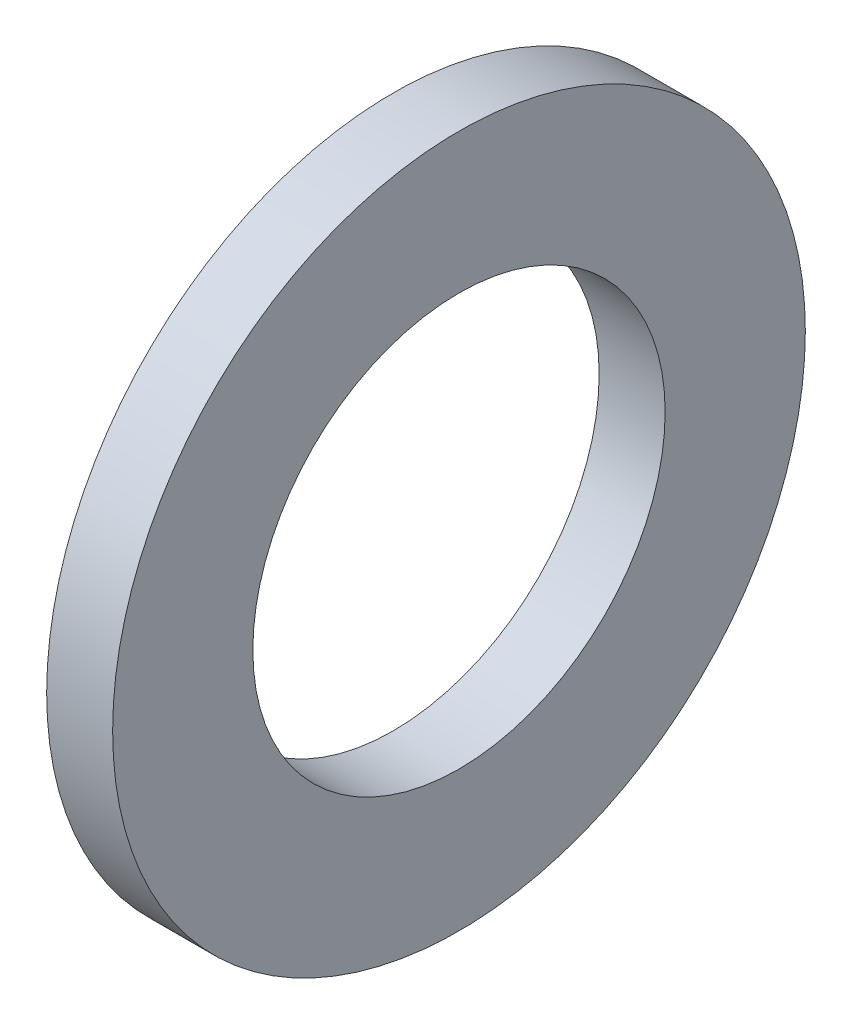
ISO-10303-21;
HEADER;
FILE_DESCRIPTION(('STEP AP214'),'2;1');
FILE_NAME('part.step','',(''),(''),'','','');
FILE_SCHEMA(('AUTOMOTIVE_DESIGN { 1 0 10303 214 1 1 1 1 }'));
ENDSEC;
DATA;
#1=APPLICATION_CONTEXT('core data for automotive mechanical design processes');
#2=APPLICATION_PROTOCOL_DEFINITION('international standard','automotive_design',2000,#1);
#3=PRODUCT_CONTEXT('',#1,'mechanical');
#4=PRODUCT('Part','Part','',(#3));
#5=PRODUCT_RELATED_PRODUCT_CATEGORY('part','',(#4));
#6=PRODUCT_DEFINITION_FORMATION('','',#4);
#7=PRODUCT_DEFINITION_CONTEXT('part definition',#1,'design');
#8=PRODUCT_DEFINITION('design','',#6,#7);
#9=PRODUCT_DEFINITION_SHAPE('','',#8);
#10=(LENGTH_UNIT() NAMED_UNIT(*) SI_UNIT(.MILLI.,.METRE.));
#11=(NAMED_UNIT(*) PLANE_ANGLE_UNIT() SI_UNIT($,.RADIAN.));
#12=(NAMED_UNIT(*) SI_UNIT($,.STERADIAN.) SOLID_ANGLE_UNIT());
#13=UNCERTAINTY_MEASURE_WITH_UNIT(LENGTH_MEASURE(1.E-05),#10,'distance_accuracy_value','');
#14=(GEOMETRIC_REPRESENTATION_CONTEXT(3) GLOBAL_UNCERTAINTY_ASSIGNED_CONTEXT((#13)) GLOBAL_UNIT_ASSIGNED_CONTEXT((#10,
#11,#12)) REPRESENTATION_CONTEXT('',''));
#15=CARTESIAN_POINT('',(0.,0.,0.));
#16=DIRECTION('',(0.,0.,1.));
#17=DIRECTION('',(1.,0.,0.));
#18=AXIS2_PLACEMENT_3D('',#15,#16,#17);
#19=CARTESIAN_POINT('',(4.,0.,0.));
#20=DIRECTION('',(1.,0.,0.));
#21=DIRECTION('',(0.,0.,-1.));
#22=AXIS2_PLACEMENT_3D('',#19,#20,#21);
#23=PLANE('',#22);
#24=CARTESIAN_POINT('',(4.,0.,0.));
#25=DIRECTION('',(1.,0.,0.));
#26=DIRECTION('',(0.,0.,-1.));
#27=AXIS2_PLACEMENT_3D('',#24,#25,#26);
#28=CIRCLE('',#27,21.);
#29=CARTESIAN_POINT('',(4.,0.,-21.));
#30=VERTEX_POINT('',#29);
#31=EDGE_CURVE('E10',#30,#30,#28,.T.);
#32=ORIENTED_EDGE('',*,*,#31,.T.);
#33=EDGE_LOOP('',(#32));
#34=FACE_BOUND('',#33,.T.);
#35=CARTESIAN_POINT('',(4.,0.,0.));
#36=DIRECTION('',(1.,0.,0.));
#37=DIRECTION('',(0.,0.,-1.));
#38=AXIS2_PLACEMENT_3D('',#35,#36,#37);
#39=CIRCLE('',#38,12.5);
#40=CARTESIAN_POINT('',(4.,0.,-12.5));
#41=VERTEX_POINT('',#40);
#42=EDGE_CURVE('E41',#41,#41,#39,.T.);
#43=ORIENTED_EDGE('',*,*,#42,.F.);
#44=EDGE_LOOP('',(#43));
#45=FACE_BOUND('',#44,.T.);
#46=ADVANCED_FACE('F30',(#34,#45),#23,.T.);
#47=CARTESIAN_POINT('',(0.,0.,0.));
#48=DIRECTION('',(1.,0.,0.));
#49=DIRECTION('',(0.,0.,-1.));
#50=AXIS2_PLACEMENT_3D('',#47,#48,#49);
#51=PLANE('',#50);
#52=CARTESIAN_POINT('',(0.,0.,0.));
#53=DIRECTION('',(1.,0.,0.));
#54=DIRECTION('',(0.,0.,-1.));
#55=AXIS2_PLACEMENT_3D('',#52,#53,#54);
#56=CIRCLE('',#55,21.);
#57=CARTESIAN_POINT('',(0.,0.,-21.));
#58=VERTEX_POINT('',#57);
#59=EDGE_CURVE('E34',#58,#58,#56,.T.);
#60=ORIENTED_EDGE('',*,*,#59,.F.);
#61=EDGE_LOOP('',(#60));
#62=FACE_BOUND('',#61,.T.);
#63=CARTESIAN_POINT('',(0.,0.,0.));
#64=DIRECTION('',(1.,0.,0.));
#65=DIRECTION('',(0.,0.,-1.));
#66=AXIS2_PLACEMENT_3D('',#63,#64,#65);
#67=CIRCLE('',#66,12.5);
#68=CARTESIAN_POINT('',(0.,0.,-12.5));
#69=VERTEX_POINT('',#68);
#70=EDGE_CURVE('E43',#69,#69,#67,.T.);
#71=ORIENTED_EDGE('',*,*,#70,.T.);
#72=EDGE_LOOP('',(#71));
#73=FACE_BOUND('',#72,.T.);
#74=ADVANCED_FACE('F53',(#62,#73),#51,.F.);
#75=CARTESIAN_POINT('',(4.,0.,0.));
#76=DIRECTION('',(-1.,0.,0.));
#77=DIRECTION('',(0.,0.,1.));
#78=AXIS2_PLACEMENT_3D('',#75,#76,#77);
#79=CYLINDRICAL_SURFACE('',#78,21.);
#80=ORIENTED_EDGE('',*,*,#31,.F.);
#81=EDGE_LOOP('',(#80));
#82=FACE_BOUND('',#81,.T.);
#83=ORIENTED_EDGE('',*,*,#59,.T.);
#84=EDGE_LOOP('',(#83));
#85=FACE_BOUND('',#84,.T.);
#86=ADVANCED_FACE('F32',(#82,#85),#79,.T.);
#87=CARTESIAN_POINT('',(4.,0.,0.));
#88=DIRECTION('',(-1.,0.,0.));
#89=DIRECTION('',(0.,0.,1.));
#90=AXIS2_PLACEMENT_3D('',#87,#88,#89);
#91=CYLINDRICAL_SURFACE('',#90,12.5);
#92=ORIENTED_EDGE('',*,*,#42,.T.);
#93=EDGE_LOOP('',(#92));
#94=FACE_BOUND('',#93,.T.);
#95=ORIENTED_EDGE('',*,*,#70,.F.);
#96=EDGE_LOOP('',(#95));
#97=FACE_BOUND('',#96,.T.);
#98=ADVANCED_FACE('F49',(#94,#97),#91,.F.);
#99=CLOSED_SHELL('',(#46,#74,#86,#98));
#100=MANIFOLD_SOLID_BREP('B2',#99);
#101=ADVANCED_BREP_SHAPE_REPRESENTATION('',(#18,#100),#14);
#102=SHAPE_DEFINITION_REPRESENTATION(#9,#101);
ENDSEC;
END-ISO-10303-21;
